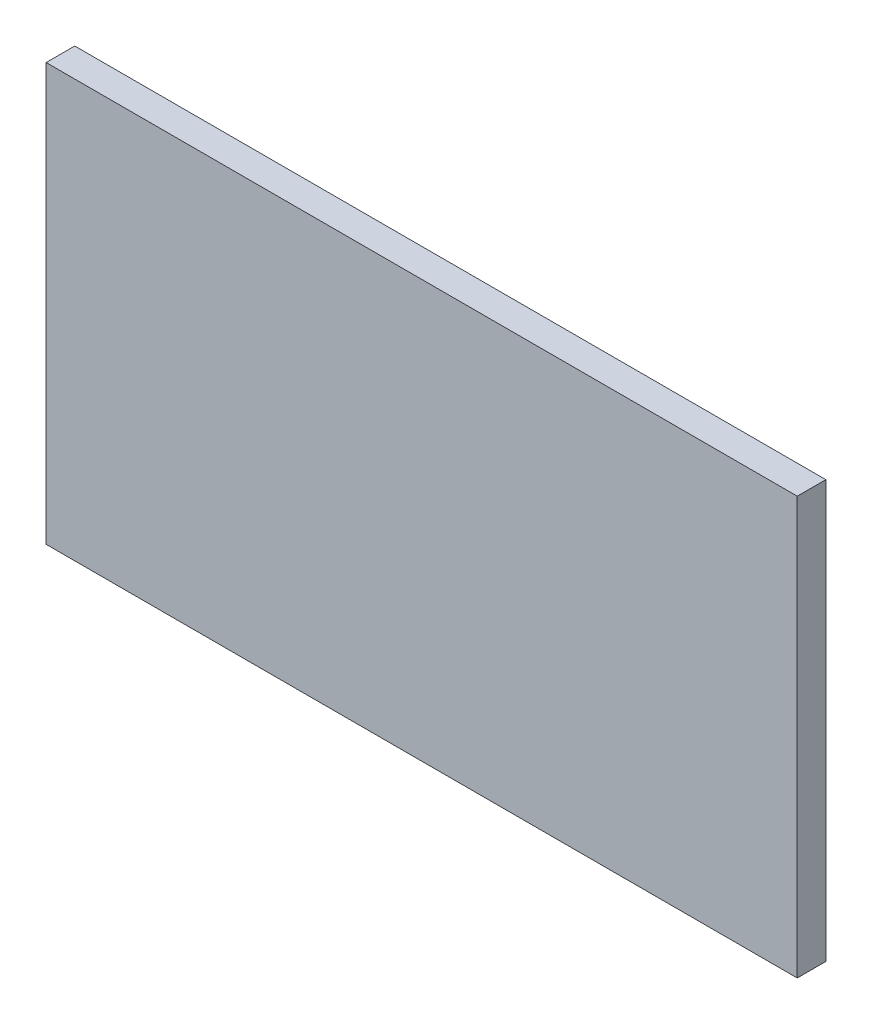
ISO-10303-21;
HEADER;
FILE_DESCRIPTION(('STEP AP214'),'2;1');
FILE_NAME('part.step','',(''),(''),'','','');
FILE_SCHEMA(('AUTOMOTIVE_DESIGN { 1 0 10303 214 1 1 1 1 }'));
ENDSEC;
DATA;
#1=APPLICATION_CONTEXT('core data for automotive mechanical design processes');
#2=APPLICATION_PROTOCOL_DEFINITION('international standard','automotive_design',2000,#1);
#3=PRODUCT_CONTEXT('',#1,'mechanical');
#4=PRODUCT('Part','Part','',(#3));
#5=PRODUCT_RELATED_PRODUCT_CATEGORY('part','',(#4));
#6=PRODUCT_DEFINITION_FORMATION('','',#4);
#7=PRODUCT_DEFINITION_CONTEXT('part definition',#1,'design');
#8=PRODUCT_DEFINITION('design','',#6,#7);
#9=PRODUCT_DEFINITION_SHAPE('','',#8);
#10=(LENGTH_UNIT() NAMED_UNIT(*) SI_UNIT(.MILLI.,.METRE.));
#11=(NAMED_UNIT(*) PLANE_ANGLE_UNIT() SI_UNIT($,.RADIAN.));
#12=(NAMED_UNIT(*) SI_UNIT($,.STERADIAN.) SOLID_ANGLE_UNIT());
#13=UNCERTAINTY_MEASURE_WITH_UNIT(LENGTH_MEASURE(1.E-05),#10,'distance_accuracy_value','');
#14=(GEOMETRIC_REPRESENTATION_CONTEXT(3) GLOBAL_UNCERTAINTY_ASSIGNED_CONTEXT((#13)) GLOBAL_UNIT_ASSIGNED_CONTEXT((#10,
#11,#12)) REPRESENTATION_CONTEXT('',''));
#15=CARTESIAN_POINT('',(0.,0.,0.));
#16=DIRECTION('',(0.,0.,1.));
#17=DIRECTION('',(1.,0.,0.));
#18=AXIS2_PLACEMENT_3D('',#15,#16,#17);
#19=CARTESIAN_POINT('',(0.70008,8.8,0.));
#20=DIRECTION('',(0.,0.,-1.));
#21=DIRECTION('',(-1.,0.,0.));
#22=AXIS2_PLACEMENT_3D('',#19,#20,#21);
#23=PLANE('',#22);
#24=DIRECTION('',(1.,0.,0.));
#25=VECTOR('',#24,1.);
#26=CARTESIAN_POINT('',(0.25008,9.05,0.));
#27=LINE('',#26,#25);
#28=CARTESIAN_POINT('',(0.25008,9.05,0.));
#29=VERTEX_POINT('',#28);
#30=CARTESIAN_POINT('',(1.15008,9.05,0.));
#31=VERTEX_POINT('',#30);
#32=EDGE_CURVE('E55',#29,#31,#27,.T.);
#33=ORIENTED_EDGE('',*,*,#32,.T.);
#34=DIRECTION('',(0.,1.,0.));
#35=VECTOR('',#34,1.);
#36=CARTESIAN_POINT('',(1.15008,9.05,0.));
#37=LINE('',#36,#35);
#38=CARTESIAN_POINT('',(1.15008,8.55,0.));
#39=VERTEX_POINT('',#38);
#40=EDGE_CURVE('E57',#31,#39,#37,.F.);
#41=ORIENTED_EDGE('',*,*,#40,.T.);
#42=DIRECTION('',(1.,0.,0.));
#43=VECTOR('',#42,1.);
#44=CARTESIAN_POINT('',(1.15008,8.55,0.));
#45=LINE('',#44,#43);
#46=CARTESIAN_POINT('',(0.25008,8.55,0.));
#47=VERTEX_POINT('',#46);
#48=EDGE_CURVE('E20',#39,#47,#45,.F.);
#49=ORIENTED_EDGE('',*,*,#48,.T.);
#50=DIRECTION('',(0.,1.,0.));
#51=VECTOR('',#50,1.);
#52=CARTESIAN_POINT('',(0.25008,8.55,0.));
#53=LINE('',#52,#51);
#54=EDGE_CURVE('E80',#47,#29,#53,.T.);
#55=ORIENTED_EDGE('',*,*,#54,.T.);
#56=EDGE_LOOP('',(#33,#41,#49,#55));
#57=FACE_BOUND('',#56,.T.);
#58=ADVANCED_FACE('F17',(#57),#23,.T.);
#59=CARTESIAN_POINT('',(1.15008,8.55,0.));
#60=DIRECTION('',(0.,1.,0.));
#61=DIRECTION('',(0.,0.,1.));
#62=AXIS2_PLACEMENT_3D('',#59,#60,#61);
#63=PLANE('',#62);
#64=DIRECTION('',(0.,0.,-1.));
#65=VECTOR('',#64,1.);
#66=CARTESIAN_POINT('',(0.25008,8.55,0.));
#67=LINE('',#66,#65);
#68=CARTESIAN_POINT('',(0.25008,8.55,0.03429));
#69=VERTEX_POINT('',#68);
#70=EDGE_CURVE('E68',#69,#47,#67,.T.);
#71=ORIENTED_EDGE('',*,*,#70,.T.);
#72=ORIENTED_EDGE('',*,*,#48,.F.);
#73=DIRECTION('',(0.,0.,1.));
#74=VECTOR('',#73,1.);
#75=CARTESIAN_POINT('',(1.15008,8.55,0.));
#76=LINE('',#75,#74);
#77=CARTESIAN_POINT('',(1.15008,8.55,0.03429));
#78=VERTEX_POINT('',#77);
#79=EDGE_CURVE('E63',#39,#78,#76,.T.);
#80=ORIENTED_EDGE('',*,*,#79,.T.);
#81=DIRECTION('',(1.,0.,0.));
#82=VECTOR('',#81,1.);
#83=CARTESIAN_POINT('',(0.70008,8.55,0.03429));
#84=LINE('',#83,#82);
#85=EDGE_CURVE('E83',#69,#78,#84,.T.);
#86=ORIENTED_EDGE('',*,*,#85,.F.);
#87=EDGE_LOOP('',(#71,#72,#80,#86));
#88=FACE_BOUND('',#87,.T.);
#89=ADVANCED_FACE('F65',(#88),#63,.F.);
#90=CARTESIAN_POINT('',(1.15008,9.05,0.));
#91=DIRECTION('',(-1.,0.,0.));
#92=DIRECTION('',(0.,0.,1.));
#93=AXIS2_PLACEMENT_3D('',#90,#91,#92);
#94=PLANE('',#93);
#95=ORIENTED_EDGE('',*,*,#79,.F.);
#96=ORIENTED_EDGE('',*,*,#40,.F.);
#97=DIRECTION('',(0.,0.,-1.));
#98=VECTOR('',#97,1.);
#99=CARTESIAN_POINT('',(1.15008,9.05,0.));
#100=LINE('',#99,#98);
#101=CARTESIAN_POINT('',(1.15008,9.05,0.03429));
#102=VERTEX_POINT('',#101);
#103=EDGE_CURVE('E75',#31,#102,#100,.F.);
#104=ORIENTED_EDGE('',*,*,#103,.T.);
#105=DIRECTION('',(0.,1.,0.));
#106=VECTOR('',#105,1.);
#107=CARTESIAN_POINT('',(1.15008,8.8,0.03429));
#108=LINE('',#107,#106);
#109=EDGE_CURVE('E72',#78,#102,#108,.T.);
#110=ORIENTED_EDGE('',*,*,#109,.F.);
#111=EDGE_LOOP('',(#95,#96,#104,#110));
#112=FACE_BOUND('',#111,.T.);
#113=ADVANCED_FACE('F70',(#112),#94,.F.);
#114=CARTESIAN_POINT('',(0.25008,9.05,0.));
#115=DIRECTION('',(0.,-1.,0.));
#116=DIRECTION('',(0.,0.,-1.));
#117=AXIS2_PLACEMENT_3D('',#114,#115,#116);
#118=PLANE('',#117);
#119=ORIENTED_EDGE('',*,*,#103,.F.);
#120=ORIENTED_EDGE('',*,*,#32,.F.);
#121=DIRECTION('',(0.,0.,-1.));
#122=VECTOR('',#121,1.);
#123=CARTESIAN_POINT('',(0.25008,9.05,0.));
#124=LINE('',#123,#122);
#125=CARTESIAN_POINT('',(0.25008,9.05,0.03429));
#126=VERTEX_POINT('',#125);
#127=EDGE_CURVE('E35',#29,#126,#124,.F.);
#128=ORIENTED_EDGE('',*,*,#127,.T.);
#129=DIRECTION('',(1.,0.,0.));
#130=VECTOR('',#129,1.);
#131=CARTESIAN_POINT('',(0.70008,9.05,0.03429));
#132=LINE('',#131,#130);
#133=EDGE_CURVE('E26',#102,#126,#132,.F.);
#134=ORIENTED_EDGE('',*,*,#133,.F.);
#135=EDGE_LOOP('',(#119,#120,#128,#134));
#136=FACE_BOUND('',#135,.T.);
#137=ADVANCED_FACE('F89',(#136),#118,.F.);
#138=CARTESIAN_POINT('',(0.25008,8.55,0.));
#139=DIRECTION('',(1.,0.,0.));
#140=DIRECTION('',(0.,0.,-1.));
#141=AXIS2_PLACEMENT_3D('',#138,#139,#140);
#142=PLANE('',#141);
#143=ORIENTED_EDGE('',*,*,#127,.F.);
#144=ORIENTED_EDGE('',*,*,#54,.F.);
#145=ORIENTED_EDGE('',*,*,#70,.F.);
#146=DIRECTION('',(0.,1.,0.));
#147=VECTOR('',#146,1.);
#148=CARTESIAN_POINT('',(0.25008,8.8,0.03429));
#149=LINE('',#148,#147);
#150=EDGE_CURVE('E11',#126,#69,#149,.F.);
#151=ORIENTED_EDGE('',*,*,#150,.F.);
#152=EDGE_LOOP('',(#143,#144,#145,#151));
#153=FACE_BOUND('',#152,.T.);
#154=ADVANCED_FACE('F91',(#153),#142,.F.);
#155=CARTESIAN_POINT('',(0.70008,8.8,0.03429));
#156=DIRECTION('',(0.,0.,1.));
#157=DIRECTION('',(1.,0.,0.));
#158=AXIS2_PLACEMENT_3D('',#155,#156,#157);
#159=PLANE('',#158);
#160=ORIENTED_EDGE('',*,*,#133,.T.);
#161=ORIENTED_EDGE('',*,*,#150,.T.);
#162=ORIENTED_EDGE('',*,*,#85,.T.);
#163=ORIENTED_EDGE('',*,*,#109,.T.);
#164=EDGE_LOOP('',(#160,#161,#162,#163));
#165=FACE_BOUND('',#164,.T.);
#166=ADVANCED_FACE('F88',(#165),#159,.T.);
#167=CLOSED_SHELL('',(#58,#89,#113,#137,#154,#166));
#168=MANIFOLD_SOLID_BREP('B1',#167);
#169=ADVANCED_BREP_SHAPE_REPRESENTATION('',(#18,#168),#14);
#170=SHAPE_DEFINITION_REPRESENTATION(#9,#169);
ENDSEC;
END-ISO-10303-21;
